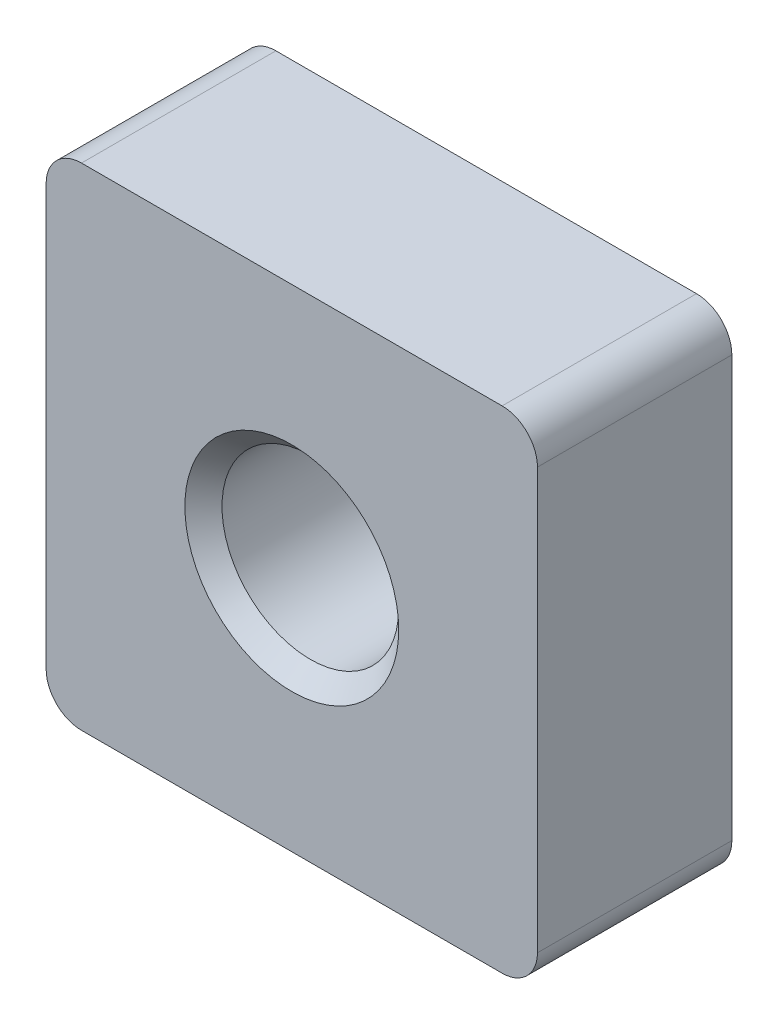
ISO-10303-21;
HEADER;
FILE_DESCRIPTION(('STEP AP214'),'2;1');
FILE_NAME('part.step','',(''),(''),'','','');
FILE_SCHEMA(('AUTOMOTIVE_DESIGN { 1 0 10303 214 1 1 1 1 }'));
ENDSEC;
DATA;
#1=APPLICATION_CONTEXT('core data for automotive mechanical design processes');
#2=APPLICATION_PROTOCOL_DEFINITION('international standard','automotive_design',2000,#1);
#3=PRODUCT_CONTEXT('',#1,'mechanical');
#4=PRODUCT('Part','Part','',(#3));
#5=PRODUCT_RELATED_PRODUCT_CATEGORY('part','',(#4));
#6=PRODUCT_DEFINITION_FORMATION('','',#4);
#7=PRODUCT_DEFINITION_CONTEXT('part definition',#1,'design');
#8=PRODUCT_DEFINITION('design','',#6,#7);
#9=PRODUCT_DEFINITION_SHAPE('','',#8);
#10=(LENGTH_UNIT() NAMED_UNIT(*) SI_UNIT(.MILLI.,.METRE.));
#11=(NAMED_UNIT(*) PLANE_ANGLE_UNIT() SI_UNIT($,.RADIAN.));
#12=(NAMED_UNIT(*) SI_UNIT($,.STERADIAN.) SOLID_ANGLE_UNIT());
#13=UNCERTAINTY_MEASURE_WITH_UNIT(LENGTH_MEASURE(1.E-05),#10,'distance_accuracy_value','');
#14=(GEOMETRIC_REPRESENTATION_CONTEXT(3) GLOBAL_UNCERTAINTY_ASSIGNED_CONTEXT((#13)) GLOBAL_UNIT_ASSIGNED_CONTEXT((#10,
#11,#12)) REPRESENTATION_CONTEXT('',''));
#15=CARTESIAN_POINT('',(0.,0.,0.));
#16=DIRECTION('',(0.,0.,1.));
#17=DIRECTION('',(1.,0.,0.));
#18=AXIS2_PLACEMENT_3D('',#15,#16,#17);
#19=CARTESIAN_POINT('',(6.95,-6.95,5.5));
#20=DIRECTION('',(-1.,0.,0.));
#21=DIRECTION('',(0.,0.,1.));
#22=AXIS2_PLACEMENT_3D('',#19,#20,#21);
#23=PLANE('',#22);
#24=DIRECTION('',(0.,1.,0.));
#25=VECTOR('',#24,1.);
#26=CARTESIAN_POINT('',(6.95,-6.95,0.));
#27=LINE('',#26,#25);
#28=CARTESIAN_POINT('',(6.95,-5.95,0.));
#29=VERTEX_POINT('',#28);
#30=CARTESIAN_POINT('',(6.95,5.95,0.));
#31=VERTEX_POINT('',#30);
#32=EDGE_CURVE('E129',#29,#31,#27,.T.);
#33=ORIENTED_EDGE('',*,*,#32,.T.);
#34=DIRECTION('',(0.,0.,-1.));
#35=VECTOR('',#34,1.);
#36=CARTESIAN_POINT('',(6.95,5.95,5.5));
#37=LINE('',#36,#35);
#38=CARTESIAN_POINT('',(6.95,5.95,5.5));
#39=VERTEX_POINT('',#38);
#40=EDGE_CURVE('E107',#31,#39,#37,.F.);
#41=ORIENTED_EDGE('',*,*,#40,.T.);
#42=DIRECTION('',(0.,1.,0.));
#43=VECTOR('',#42,1.);
#44=CARTESIAN_POINT('',(6.95,-6.95,5.5));
#45=LINE('',#44,#43);
#46=CARTESIAN_POINT('',(6.95,-5.95,5.5));
#47=VERTEX_POINT('',#46);
#48=EDGE_CURVE('E139',#47,#39,#45,.T.);
#49=ORIENTED_EDGE('',*,*,#48,.F.);
#50=DIRECTION('',(0.,0.,-1.));
#51=VECTOR('',#50,1.);
#52=CARTESIAN_POINT('',(6.95,-5.95,5.5));
#53=LINE('',#52,#51);
#54=EDGE_CURVE('E112',#47,#29,#53,.T.);
#55=ORIENTED_EDGE('',*,*,#54,.T.);
#56=EDGE_LOOP('',(#33,#41,#49,#55));
#57=FACE_BOUND('',#56,.T.);
#58=ADVANCED_FACE('F37',(#57),#23,.F.);
#59=CARTESIAN_POINT('',(-6.95,6.95,5.5));
#60=DIRECTION('',(0.,-1.,0.));
#61=DIRECTION('',(0.,0.,-1.));
#62=AXIS2_PLACEMENT_3D('',#59,#60,#61);
#63=PLANE('',#62);
#64=DIRECTION('',(-1.,0.,0.));
#65=VECTOR('',#64,1.);
#66=CARTESIAN_POINT('',(-6.95,6.95,5.5));
#67=LINE('',#66,#65);
#68=CARTESIAN_POINT('',(5.95,6.95,5.5));
#69=VERTEX_POINT('',#68);
#70=CARTESIAN_POINT('',(-5.95,6.95,5.5));
#71=VERTEX_POINT('',#70);
#72=EDGE_CURVE('E122',#69,#71,#67,.T.);
#73=ORIENTED_EDGE('',*,*,#72,.F.);
#74=DIRECTION('',(0.,0.,-1.));
#75=VECTOR('',#74,1.);
#76=CARTESIAN_POINT('',(5.95,6.95,5.5));
#77=LINE('',#76,#75);
#78=CARTESIAN_POINT('',(5.95,6.95,0.));
#79=VERTEX_POINT('',#78);
#80=EDGE_CURVE('E106',#69,#79,#77,.T.);
#81=ORIENTED_EDGE('',*,*,#80,.T.);
#82=DIRECTION('',(-1.,0.,0.));
#83=VECTOR('',#82,1.);
#84=CARTESIAN_POINT('',(-6.95,6.95,0.));
#85=LINE('',#84,#83);
#86=CARTESIAN_POINT('',(-5.95,6.95,0.));
#87=VERTEX_POINT('',#86);
#88=EDGE_CURVE('E119',#79,#87,#85,.T.);
#89=ORIENTED_EDGE('',*,*,#88,.T.);
#90=DIRECTION('',(0.,0.,-1.));
#91=VECTOR('',#90,1.);
#92=CARTESIAN_POINT('',(-5.95,6.95,5.5));
#93=LINE('',#92,#91);
#94=EDGE_CURVE('E124',#87,#71,#93,.F.);
#95=ORIENTED_EDGE('',*,*,#94,.T.);
#96=EDGE_LOOP('',(#73,#81,#89,#95));
#97=FACE_BOUND('',#96,.T.);
#98=ADVANCED_FACE('F118',(#97),#63,.F.);
#99=CARTESIAN_POINT('',(-6.95,-6.95,5.5));
#100=DIRECTION('',(1.,0.,0.));
#101=DIRECTION('',(0.,0.,-1.));
#102=AXIS2_PLACEMENT_3D('',#99,#100,#101);
#103=PLANE('',#102);
#104=DIRECTION('',(0.,-1.,0.));
#105=VECTOR('',#104,1.);
#106=CARTESIAN_POINT('',(-6.95,-6.95,5.5));
#107=LINE('',#106,#105);
#108=CARTESIAN_POINT('',(-6.95,5.95,5.5));
#109=VERTEX_POINT('',#108);
#110=CARTESIAN_POINT('',(-6.95,-5.95,5.5));
#111=VERTEX_POINT('',#110);
#112=EDGE_CURVE('E173',#109,#111,#107,.T.);
#113=ORIENTED_EDGE('',*,*,#112,.F.);
#114=DIRECTION('',(0.,0.,-1.));
#115=VECTOR('',#114,1.);
#116=CARTESIAN_POINT('',(-6.95,5.95,5.5));
#117=LINE('',#116,#115);
#118=CARTESIAN_POINT('',(-6.95,5.95,0.));
#119=VERTEX_POINT('',#118);
#120=EDGE_CURVE('E158',#109,#119,#117,.T.);
#121=ORIENTED_EDGE('',*,*,#120,.T.);
#122=DIRECTION('',(0.,-1.,0.));
#123=VECTOR('',#122,1.);
#124=CARTESIAN_POINT('',(-6.95,-6.95,0.));
#125=LINE('',#124,#123);
#126=CARTESIAN_POINT('',(-6.95,-5.95,0.));
#127=VERTEX_POINT('',#126);
#128=EDGE_CURVE('E128',#119,#127,#125,.T.);
#129=ORIENTED_EDGE('',*,*,#128,.T.);
#130=DIRECTION('',(0.,0.,-1.));
#131=VECTOR('',#130,1.);
#132=CARTESIAN_POINT('',(-6.95,-5.95,5.5));
#133=LINE('',#132,#131);
#134=EDGE_CURVE('E156',#127,#111,#133,.F.);
#135=ORIENTED_EDGE('',*,*,#134,.T.);
#136=EDGE_LOOP('',(#113,#121,#129,#135));
#137=FACE_BOUND('',#136,.T.);
#138=ADVANCED_FACE('F189',(#137),#103,.F.);
#139=CARTESIAN_POINT('',(-6.95,-6.95,5.5));
#140=DIRECTION('',(0.,1.,0.));
#141=DIRECTION('',(0.,0.,1.));
#142=AXIS2_PLACEMENT_3D('',#139,#140,#141);
#143=PLANE('',#142);
#144=DIRECTION('',(1.,0.,0.));
#145=VECTOR('',#144,1.);
#146=CARTESIAN_POINT('',(-6.95,-6.95,0.));
#147=LINE('',#146,#145);
#148=CARTESIAN_POINT('',(-5.95,-6.95,0.));
#149=VERTEX_POINT('',#148);
#150=CARTESIAN_POINT('',(5.95,-6.95,0.));
#151=VERTEX_POINT('',#150);
#152=EDGE_CURVE('E132',#149,#151,#147,.T.);
#153=ORIENTED_EDGE('',*,*,#152,.T.);
#154=DIRECTION('',(0.,0.,-1.));
#155=VECTOR('',#154,1.);
#156=CARTESIAN_POINT('',(5.95,-6.95,5.5));
#157=LINE('',#156,#155);
#158=CARTESIAN_POINT('',(5.95,-6.95,5.5));
#159=VERTEX_POINT('',#158);
#160=EDGE_CURVE('E11',#151,#159,#157,.F.);
#161=ORIENTED_EDGE('',*,*,#160,.T.);
#162=DIRECTION('',(1.,0.,0.));
#163=VECTOR('',#162,1.);
#164=CARTESIAN_POINT('',(-6.95,-6.95,5.5));
#165=LINE('',#164,#163);
#166=CARTESIAN_POINT('',(-5.95,-6.95,5.5));
#167=VERTEX_POINT('',#166);
#168=EDGE_CURVE('E140',#167,#159,#165,.T.);
#169=ORIENTED_EDGE('',*,*,#168,.F.);
#170=DIRECTION('',(0.,0.,-1.));
#171=VECTOR('',#170,1.);
#172=CARTESIAN_POINT('',(-5.95,-6.95,5.5));
#173=LINE('',#172,#171);
#174=EDGE_CURVE('E45',#167,#149,#173,.T.);
#175=ORIENTED_EDGE('',*,*,#174,.T.);
#176=EDGE_LOOP('',(#153,#161,#169,#175));
#177=FACE_BOUND('',#176,.T.);
#178=ADVANCED_FACE('F163',(#177),#143,.F.);
#179=CARTESIAN_POINT('',(0.,0.,5.5));
#180=DIRECTION('',(0.,0.,-1.));
#181=DIRECTION('',(-1.,0.,0.));
#182=AXIS2_PLACEMENT_3D('',#179,#180,#181);
#183=PLANE('',#182);
#184=CARTESIAN_POINT('',(0.,0.,5.5));
#185=DIRECTION('',(0.,0.,1.));
#186=DIRECTION('',(1.,0.,0.));
#187=AXIS2_PLACEMENT_3D('',#184,#185,#186);
#188=CIRCLE('',#187,3.025);
#189=CARTESIAN_POINT('',(3.025,0.,5.5));
#190=VERTEX_POINT('',#189);
#191=EDGE_CURVE('E298',#190,#190,#188,.T.);
#192=ORIENTED_EDGE('',*,*,#191,.F.);
#193=EDGE_LOOP('',(#192));
#194=FACE_BOUND('',#193,.T.);
#195=ORIENTED_EDGE('',*,*,#48,.T.);
#196=CARTESIAN_POINT('',(5.95,5.95,5.5));
#197=DIRECTION('',(0.,0.,-1.));
#198=DIRECTION('',(-1.,0.,0.));
#199=AXIS2_PLACEMENT_3D('',#196,#197,#198);
#200=CIRCLE('',#199,1.);
#201=EDGE_CURVE('E154',#39,#69,#200,.F.);
#202=ORIENTED_EDGE('',*,*,#201,.T.);
#203=ORIENTED_EDGE('',*,*,#72,.T.);
#204=CARTESIAN_POINT('',(-5.95,5.95,5.5));
#205=DIRECTION('',(0.,0.,-1.));
#206=DIRECTION('',(-1.,0.,0.));
#207=AXIS2_PLACEMENT_3D('',#204,#205,#206);
#208=CIRCLE('',#207,1.);
#209=EDGE_CURVE('E152',#71,#109,#208,.F.);
#210=ORIENTED_EDGE('',*,*,#209,.T.);
#211=ORIENTED_EDGE('',*,*,#112,.T.);
#212=CARTESIAN_POINT('',(-5.95,-5.95,5.5));
#213=DIRECTION('',(0.,0.,-1.));
#214=DIRECTION('',(-1.,0.,0.));
#215=AXIS2_PLACEMENT_3D('',#212,#213,#214);
#216=CIRCLE('',#215,1.);
#217=EDGE_CURVE('E57',#111,#167,#216,.F.);
#218=ORIENTED_EDGE('',*,*,#217,.T.);
#219=ORIENTED_EDGE('',*,*,#168,.T.);
#220=CARTESIAN_POINT('',(5.95,-5.95,5.5));
#221=DIRECTION('',(0.,0.,-1.));
#222=DIRECTION('',(-1.,0.,0.));
#223=AXIS2_PLACEMENT_3D('',#220,#221,#222);
#224=CIRCLE('',#223,1.);
#225=EDGE_CURVE('E150',#159,#47,#224,.F.);
#226=ORIENTED_EDGE('',*,*,#225,.T.);
#227=EDGE_LOOP('',(#195,#202,#203,#210,#211,#218,#219,#226));
#228=FACE_BOUND('',#227,.T.);
#229=ADVANCED_FACE('F178',(#194,#228),#183,.F.);
#230=CARTESIAN_POINT('',(0.,0.,0.));
#231=DIRECTION('',(0.,0.,-1.));
#232=DIRECTION('',(-1.,0.,0.));
#233=AXIS2_PLACEMENT_3D('',#230,#231,#232);
#234=PLANE('',#233);
#235=CARTESIAN_POINT('',(0.,0.,0.));
#236=DIRECTION('',(0.,0.,1.));
#237=DIRECTION('',(1.,0.,0.));
#238=AXIS2_PLACEMENT_3D('',#235,#236,#237);
#239=CIRCLE('',#238,3.025);
#240=CARTESIAN_POINT('',(3.025,0.,0.));
#241=VERTEX_POINT('',#240);
#242=EDGE_CURVE('E293',#241,#241,#239,.T.);
#243=ORIENTED_EDGE('',*,*,#242,.T.);
#244=EDGE_LOOP('',(#243));
#245=FACE_BOUND('',#244,.T.);
#246=ORIENTED_EDGE('',*,*,#88,.F.);
#247=CARTESIAN_POINT('',(5.95,5.95,0.));
#248=DIRECTION('',(0.,0.,-1.));
#249=DIRECTION('',(-1.,0.,0.));
#250=AXIS2_PLACEMENT_3D('',#247,#248,#249);
#251=CIRCLE('',#250,1.);
#252=EDGE_CURVE('E102',#79,#31,#251,.T.);
#253=ORIENTED_EDGE('',*,*,#252,.T.);
#254=ORIENTED_EDGE('',*,*,#32,.F.);
#255=CARTESIAN_POINT('',(5.95,-5.95,0.));
#256=DIRECTION('',(0.,0.,-1.));
#257=DIRECTION('',(-1.,0.,0.));
#258=AXIS2_PLACEMENT_3D('',#255,#256,#257);
#259=CIRCLE('',#258,1.);
#260=EDGE_CURVE('E143',#29,#151,#259,.T.);
#261=ORIENTED_EDGE('',*,*,#260,.T.);
#262=ORIENTED_EDGE('',*,*,#152,.F.);
#263=CARTESIAN_POINT('',(-5.95,-5.95,0.));
#264=DIRECTION('',(0.,0.,-1.));
#265=DIRECTION('',(-1.,0.,0.));
#266=AXIS2_PLACEMENT_3D('',#263,#264,#265);
#267=CIRCLE('',#266,1.);
#268=EDGE_CURVE('E123',#149,#127,#267,.T.);
#269=ORIENTED_EDGE('',*,*,#268,.T.);
#270=ORIENTED_EDGE('',*,*,#128,.F.);
#271=CARTESIAN_POINT('',(-5.95,5.95,0.));
#272=DIRECTION('',(0.,0.,-1.));
#273=DIRECTION('',(-1.,0.,0.));
#274=AXIS2_PLACEMENT_3D('',#271,#272,#273);
#275=CIRCLE('',#274,1.);
#276=EDGE_CURVE('E113',#119,#87,#275,.T.);
#277=ORIENTED_EDGE('',*,*,#276,.T.);
#278=EDGE_LOOP('',(#246,#253,#254,#261,#262,#269,#270,#277));
#279=FACE_BOUND('',#278,.T.);
#280=ADVANCED_FACE('F126',(#245,#279),#234,.T.);
#281=CARTESIAN_POINT('',(0.,0.,0.525000000000002));
#282=DIRECTION('',(0.,0.,-1.));
#283=DIRECTION('',(-1.,0.,0.));
#284=AXIS2_PLACEMENT_3D('',#281,#282,#283);
#285=CONICAL_SURFACE('',#284,2.5,0.785398163397447);
#286=ORIENTED_EDGE('',*,*,#242,.F.);
#287=EDGE_LOOP('',(#286));
#288=FACE_BOUND('',#287,.T.);
#289=CARTESIAN_POINT('',(0.,0.,0.525000000000002));
#290=DIRECTION('',(0.,0.,1.));
#291=DIRECTION('',(1.,0.,0.));
#292=AXIS2_PLACEMENT_3D('',#289,#290,#291);
#293=CIRCLE('',#292,2.5);
#294=CARTESIAN_POINT('',(2.5,0.,0.525000000000002));
#295=VERTEX_POINT('',#294);
#296=EDGE_CURVE('E134',#295,#295,#293,.T.);
#297=ORIENTED_EDGE('',*,*,#296,.T.);
#298=EDGE_LOOP('',(#297));
#299=FACE_BOUND('',#298,.T.);
#300=ADVANCED_FACE('F186',(#288,#299),#285,.F.);
#301=CARTESIAN_POINT('',(0.,0.,5.5));
#302=DIRECTION('',(0.,0.,1.));
#303=DIRECTION('',(1.,0.,0.));
#304=AXIS2_PLACEMENT_3D('',#301,#302,#303);
#305=CYLINDRICAL_SURFACE('',#304,2.5);
#306=ORIENTED_EDGE('',*,*,#296,.F.);
#307=EDGE_LOOP('',(#306));
#308=FACE_BOUND('',#307,.T.);
#309=CARTESIAN_POINT('',(0.,0.,4.975));
#310=DIRECTION('',(0.,0.,1.));
#311=DIRECTION('',(1.,0.,0.));
#312=AXIS2_PLACEMENT_3D('',#309,#310,#311);
#313=CIRCLE('',#312,2.5);
#314=CARTESIAN_POINT('',(2.5,0.,4.975));
#315=VERTEX_POINT('',#314);
#316=EDGE_CURVE('E296',#315,#315,#313,.T.);
#317=ORIENTED_EDGE('',*,*,#316,.T.);
#318=EDGE_LOOP('',(#317));
#319=FACE_BOUND('',#318,.T.);
#320=ADVANCED_FACE('F268',(#308,#319),#305,.F.);
#321=CARTESIAN_POINT('',(0.,0.,5.5));
#322=DIRECTION('',(0.,0.,1.));
#323=DIRECTION('',(1.,0.,0.));
#324=AXIS2_PLACEMENT_3D('',#321,#322,#323);
#325=CONICAL_SURFACE('',#324,3.025,0.785398163397449);
#326=ORIENTED_EDGE('',*,*,#316,.F.);
#327=EDGE_LOOP('',(#326));
#328=FACE_BOUND('',#327,.T.);
#329=ORIENTED_EDGE('',*,*,#191,.T.);
#330=EDGE_LOOP('',(#329));
#331=FACE_BOUND('',#330,.T.);
#332=ADVANCED_FACE('F204',(#328,#331),#325,.F.);
#333=CARTESIAN_POINT('',(5.95,5.95,5.5));
#334=DIRECTION('',(0.,0.,-1.));
#335=DIRECTION('',(-1.,0.,0.));
#336=AXIS2_PLACEMENT_3D('',#333,#334,#335);
#337=CYLINDRICAL_SURFACE('',#336,1.);
#338=ORIENTED_EDGE('',*,*,#201,.F.);
#339=ORIENTED_EDGE('',*,*,#40,.F.);
#340=ORIENTED_EDGE('',*,*,#252,.F.);
#341=ORIENTED_EDGE('',*,*,#80,.F.);
#342=EDGE_LOOP('',(#338,#339,#340,#341));
#343=FACE_BOUND('',#342,.T.);
#344=ADVANCED_FACE('F105',(#343),#337,.T.);
#345=CARTESIAN_POINT('',(-5.95,5.95,5.5));
#346=DIRECTION('',(0.,0.,-1.));
#347=DIRECTION('',(-1.,0.,0.));
#348=AXIS2_PLACEMENT_3D('',#345,#346,#347);
#349=CYLINDRICAL_SURFACE('',#348,1.);
#350=ORIENTED_EDGE('',*,*,#209,.F.);
#351=ORIENTED_EDGE('',*,*,#94,.F.);
#352=ORIENTED_EDGE('',*,*,#276,.F.);
#353=ORIENTED_EDGE('',*,*,#120,.F.);
#354=EDGE_LOOP('',(#350,#351,#352,#353));
#355=FACE_BOUND('',#354,.T.);
#356=ADVANCED_FACE('F203',(#355),#349,.T.);
#357=CARTESIAN_POINT('',(5.95,-5.95,5.5));
#358=DIRECTION('',(0.,0.,-1.));
#359=DIRECTION('',(-1.,0.,0.));
#360=AXIS2_PLACEMENT_3D('',#357,#358,#359);
#361=CYLINDRICAL_SURFACE('',#360,1.);
#362=ORIENTED_EDGE('',*,*,#225,.F.);
#363=ORIENTED_EDGE('',*,*,#160,.F.);
#364=ORIENTED_EDGE('',*,*,#260,.F.);
#365=ORIENTED_EDGE('',*,*,#54,.F.);
#366=EDGE_LOOP('',(#362,#363,#364,#365));
#367=FACE_BOUND('',#366,.T.);
#368=ADVANCED_FACE('F168',(#367),#361,.T.);
#369=CARTESIAN_POINT('',(-5.95,-5.95,5.5));
#370=DIRECTION('',(0.,0.,-1.));
#371=DIRECTION('',(-1.,0.,0.));
#372=AXIS2_PLACEMENT_3D('',#369,#370,#371);
#373=CYLINDRICAL_SURFACE('',#372,1.);
#374=ORIENTED_EDGE('',*,*,#217,.F.);
#375=ORIENTED_EDGE('',*,*,#134,.F.);
#376=ORIENTED_EDGE('',*,*,#268,.F.);
#377=ORIENTED_EDGE('',*,*,#174,.F.);
#378=EDGE_LOOP('',(#374,#375,#376,#377));
#379=FACE_BOUND('',#378,.T.);
#380=ADVANCED_FACE('F39',(#379),#373,.T.);
#381=CLOSED_SHELL('',(#58,#98,#138,#178,#229,#280,#300,#320,#332,#344,#356,#368,#380));
#382=MANIFOLD_SOLID_BREP('B2',#381);
#383=ADVANCED_BREP_SHAPE_REPRESENTATION('',(#18,#382),#14);
#384=SHAPE_DEFINITION_REPRESENTATION(#9,#383);
ENDSEC;
END-ISO-10303-21;
